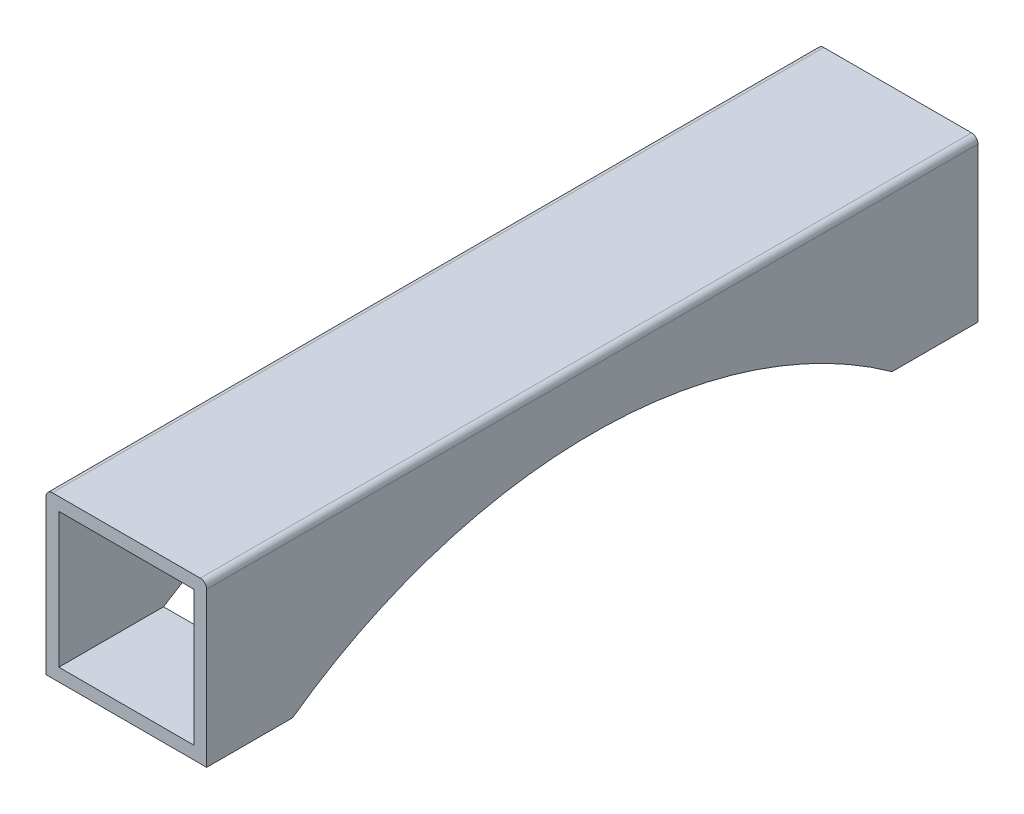
ISO-10303-21;
HEADER;
FILE_DESCRIPTION(('STEP AP214'),'2;1');
FILE_NAME('part.step','',(''),(''),'','','');
FILE_SCHEMA(('AUTOMOTIVE_DESIGN { 1 0 10303 214 1 1 1 1 }'));
ENDSEC;
DATA;
#1=APPLICATION_CONTEXT('core data for automotive mechanical design processes');
#2=APPLICATION_PROTOCOL_DEFINITION('international standard','automotive_design',2000,#1);
#3=PRODUCT_CONTEXT('',#1,'mechanical');
#4=PRODUCT('Part','Part','',(#3));
#5=PRODUCT_RELATED_PRODUCT_CATEGORY('part','',(#4));
#6=PRODUCT_DEFINITION_FORMATION('','',#4);
#7=PRODUCT_DEFINITION_CONTEXT('part definition',#1,'design');
#8=PRODUCT_DEFINITION('design','',#6,#7);
#9=PRODUCT_DEFINITION_SHAPE('','',#8);
#10=(LENGTH_UNIT() NAMED_UNIT(*) SI_UNIT(.MILLI.,.METRE.));
#11=(NAMED_UNIT(*) PLANE_ANGLE_UNIT() SI_UNIT($,.RADIAN.));
#12=(NAMED_UNIT(*) SI_UNIT($,.STERADIAN.) SOLID_ANGLE_UNIT());
#13=UNCERTAINTY_MEASURE_WITH_UNIT(LENGTH_MEASURE(1.E-05),#10,'distance_accuracy_value','');
#14=(GEOMETRIC_REPRESENTATION_CONTEXT(3) GLOBAL_UNCERTAINTY_ASSIGNED_CONTEXT((#13)) GLOBAL_UNIT_ASSIGNED_CONTEXT((#10,
#11,#12)) REPRESENTATION_CONTEXT('',''));
#15=CARTESIAN_POINT('',(0.,0.,0.));
#16=DIRECTION('',(0.,0.,1.));
#17=DIRECTION('',(1.,0.,0.));
#18=AXIS2_PLACEMENT_3D('',#15,#16,#17);
#19=CARTESIAN_POINT('',(-12.5,-12.5,-60.));
#20=DIRECTION('',(0.,-1.,0.));
#21=DIRECTION('',(0.,0.,-1.));
#22=AXIS2_PLACEMENT_3D('',#19,#20,#21);
#23=PLANE('',#22);
#24=DIRECTION('',(-1.,0.,0.));
#25=VECTOR('',#24,1.);
#26=CARTESIAN_POINT('',(12.5,-12.5,46.6368952654441));
#27=LINE('',#26,#25);
#28=CARTESIAN_POINT('',(12.5,-12.5,46.6368952654441));
#29=VERTEX_POINT('',#28);
#30=CARTESIAN_POINT('',(-12.5,-12.5,46.6368952654441));
#31=VERTEX_POINT('',#30);
#32=EDGE_CURVE('E148',#29,#31,#27,.T.);
#33=ORIENTED_EDGE('',*,*,#32,.F.);
#34=DIRECTION('',(0.,0.,1.));
#35=VECTOR('',#34,1.);
#36=CARTESIAN_POINT('',(12.5,-12.5,-60.));
#37=LINE('',#36,#35);
#38=CARTESIAN_POINT('',(12.5,-12.5,60.));
#39=VERTEX_POINT('',#38);
#40=EDGE_CURVE('E139',#29,#39,#37,.T.);
#41=ORIENTED_EDGE('',*,*,#40,.T.);
#42=DIRECTION('',(1.,0.,0.));
#43=VECTOR('',#42,1.);
#44=CARTESIAN_POINT('',(-12.5,-12.5,60.));
#45=LINE('',#44,#43);
#46=CARTESIAN_POINT('',(-12.5,-12.5,60.));
#47=VERTEX_POINT('',#46);
#48=EDGE_CURVE('E177',#47,#39,#45,.T.);
#49=ORIENTED_EDGE('',*,*,#48,.F.);
#50=DIRECTION('',(0.,0.,1.));
#51=VECTOR('',#50,1.);
#52=CARTESIAN_POINT('',(-12.5,-12.5,-60.));
#53=LINE('',#52,#51);
#54=EDGE_CURVE('E231',#31,#47,#53,.T.);
#55=ORIENTED_EDGE('',*,*,#54,.F.);
#56=EDGE_LOOP('',(#33,#41,#49,#55));
#57=FACE_BOUND('',#56,.T.);
#58=ADVANCED_FACE('F31',(#57),#23,.T.);
#59=CARTESIAN_POINT('',(-10.5,-10.5,-60.));
#60=DIRECTION('',(0.,-1.,0.));
#61=DIRECTION('',(0.,0.,-1.));
#62=AXIS2_PLACEMENT_3D('',#59,#60,#61);
#63=PLANE('',#62);
#64=DIRECTION('',(0.,0.,1.));
#65=VECTOR('',#64,1.);
#66=CARTESIAN_POINT('',(10.5,-10.5,-60.));
#67=LINE('',#66,#65);
#68=CARTESIAN_POINT('',(10.5,-10.5,43.7149859887888));
#69=VERTEX_POINT('',#68);
#70=CARTESIAN_POINT('',(10.5,-10.5,60.));
#71=VERTEX_POINT('',#70);
#72=EDGE_CURVE('E213',#69,#71,#67,.T.);
#73=ORIENTED_EDGE('',*,*,#72,.F.);
#74=DIRECTION('',(-1.,0.,0.));
#75=VECTOR('',#74,1.);
#76=CARTESIAN_POINT('',(12.5,-10.5,43.7149859887888));
#77=LINE('',#76,#75);
#78=CARTESIAN_POINT('',(-10.5,-10.5,43.7149859887888));
#79=VERTEX_POINT('',#78);
#80=EDGE_CURVE('E11',#69,#79,#77,.T.);
#81=ORIENTED_EDGE('',*,*,#80,.T.);
#82=DIRECTION('',(0.,0.,1.));
#83=VECTOR('',#82,1.);
#84=CARTESIAN_POINT('',(-10.5,-10.5,-60.));
#85=LINE('',#84,#83);
#86=CARTESIAN_POINT('',(-10.5,-10.5,60.));
#87=VERTEX_POINT('',#86);
#88=EDGE_CURVE('E204',#79,#87,#85,.T.);
#89=ORIENTED_EDGE('',*,*,#88,.T.);
#90=DIRECTION('',(1.,0.,0.));
#91=VECTOR('',#90,1.);
#92=CARTESIAN_POINT('',(-10.5,-10.5,60.));
#93=LINE('',#92,#91);
#94=EDGE_CURVE('E165',#87,#71,#93,.T.);
#95=ORIENTED_EDGE('',*,*,#94,.T.);
#96=EDGE_LOOP('',(#73,#81,#89,#95));
#97=FACE_BOUND('',#96,.T.);
#98=ADVANCED_FACE('F257',(#97),#63,.F.);
#99=CARTESIAN_POINT('',(-12.5,-12.5,-60.));
#100=DIRECTION('',(-1.,0.,0.));
#101=DIRECTION('',(0.,0.,1.));
#102=AXIS2_PLACEMENT_3D('',#99,#100,#101);
#103=PLANE('',#102);
#104=CARTESIAN_POINT('',(-12.5,-77.5,0.));
#105=DIRECTION('',(-1.,0.,0.));
#106=DIRECTION('',(0.,0.,1.));
#107=AXIS2_PLACEMENT_3D('',#104,#105,#106);
#108=CIRCLE('',#107,80.);
#109=CARTESIAN_POINT('',(-12.5,-12.5,-46.6368952654441));
#110=VERTEX_POINT('',#109);
#111=EDGE_CURVE('E46',#31,#110,#108,.T.);
#112=ORIENTED_EDGE('',*,*,#111,.F.);
#113=ORIENTED_EDGE('',*,*,#54,.T.);
#114=DIRECTION('',(0.,-1.,0.));
#115=VECTOR('',#114,1.);
#116=CARTESIAN_POINT('',(-12.5,-12.5,60.));
#117=LINE('',#116,#115);
#118=CARTESIAN_POINT('',(-12.5,11.5,60.));
#119=VERTEX_POINT('',#118);
#120=EDGE_CURVE('E174',#119,#47,#117,.T.);
#121=ORIENTED_EDGE('',*,*,#120,.F.);
#122=DIRECTION('',(0.,0.,1.));
#123=VECTOR('',#122,1.);
#124=CARTESIAN_POINT('',(-12.5,11.5,-60.));
#125=LINE('',#124,#123);
#126=CARTESIAN_POINT('',(-12.5,11.5,-60.));
#127=VERTEX_POINT('',#126);
#128=EDGE_CURVE('E232',#127,#119,#125,.T.);
#129=ORIENTED_EDGE('',*,*,#128,.F.);
#130=DIRECTION('',(0.,-1.,0.));
#131=VECTOR('',#130,1.);
#132=CARTESIAN_POINT('',(-12.5,-12.5,-60.));
#133=LINE('',#132,#131);
#134=CARTESIAN_POINT('',(-12.5,-12.5,-60.));
#135=VERTEX_POINT('',#134);
#136=EDGE_CURVE('E207',#127,#135,#133,.T.);
#137=ORIENTED_EDGE('',*,*,#136,.T.);
#138=EDGE_CURVE('E239',#135,#110,#53,.T.);
#139=ORIENTED_EDGE('',*,*,#138,.T.);
#140=EDGE_LOOP('',(#112,#113,#121,#129,#137,#139));
#141=FACE_BOUND('',#140,.T.);
#142=ADVANCED_FACE('F33',(#141),#103,.T.);
#143=CARTESIAN_POINT('',(-11.5,11.5,-60.));
#144=DIRECTION('',(0.,0.,1.));
#145=DIRECTION('',(1.,0.,0.));
#146=AXIS2_PLACEMENT_3D('',#143,#144,#145);
#147=CYLINDRICAL_SURFACE('',#146,0.999999999999999);
#148=ORIENTED_EDGE('',*,*,#128,.T.);
#149=CARTESIAN_POINT('',(-11.5,11.5,60.));
#150=DIRECTION('',(0.,0.,1.));
#151=DIRECTION('',(1.,0.,0.));
#152=AXIS2_PLACEMENT_3D('',#149,#150,#151);
#153=CIRCLE('',#152,0.999999999999999);
#154=CARTESIAN_POINT('',(-11.5,12.5,60.));
#155=VERTEX_POINT('',#154);
#156=EDGE_CURVE('E189',#155,#119,#153,.T.);
#157=ORIENTED_EDGE('',*,*,#156,.F.);
#158=DIRECTION('',(0.,0.,1.));
#159=VECTOR('',#158,1.);
#160=CARTESIAN_POINT('',(-11.5,12.5,-60.));
#161=LINE('',#160,#159);
#162=CARTESIAN_POINT('',(-11.5,12.5,-60.));
#163=VERTEX_POINT('',#162);
#164=EDGE_CURVE('E234',#163,#155,#161,.T.);
#165=ORIENTED_EDGE('',*,*,#164,.F.);
#166=CARTESIAN_POINT('',(-11.5,11.5,-60.));
#167=DIRECTION('',(0.,0.,1.));
#168=DIRECTION('',(1.,0.,0.));
#169=AXIS2_PLACEMENT_3D('',#166,#167,#168);
#170=CIRCLE('',#169,0.999999999999999);
#171=EDGE_CURVE('E228',#163,#127,#170,.T.);
#172=ORIENTED_EDGE('',*,*,#171,.T.);
#173=EDGE_LOOP('',(#148,#157,#165,#172));
#174=FACE_BOUND('',#173,.T.);
#175=ADVANCED_FACE('F298',(#174),#147,.T.);
#176=CARTESIAN_POINT('',(-11.5,12.5,-60.));
#177=DIRECTION('',(0.,1.,0.));
#178=DIRECTION('',(0.,0.,1.));
#179=AXIS2_PLACEMENT_3D('',#176,#177,#178);
#180=PLANE('',#179);
#181=ORIENTED_EDGE('',*,*,#164,.T.);
#182=DIRECTION('',(-1.,0.,0.));
#183=VECTOR('',#182,1.);
#184=CARTESIAN_POINT('',(-11.5,12.5,60.));
#185=LINE('',#184,#183);
#186=CARTESIAN_POINT('',(11.5,12.5,60.));
#187=VERTEX_POINT('',#186);
#188=EDGE_CURVE('E186',#187,#155,#185,.T.);
#189=ORIENTED_EDGE('',*,*,#188,.F.);
#190=DIRECTION('',(0.,0.,1.));
#191=VECTOR('',#190,1.);
#192=CARTESIAN_POINT('',(11.5,12.5,-60.));
#193=LINE('',#192,#191);
#194=CARTESIAN_POINT('',(11.5,12.5,-60.));
#195=VERTEX_POINT('',#194);
#196=EDGE_CURVE('E236',#195,#187,#193,.T.);
#197=ORIENTED_EDGE('',*,*,#196,.F.);
#198=DIRECTION('',(-1.,0.,0.));
#199=VECTOR('',#198,1.);
#200=CARTESIAN_POINT('',(-11.5,12.5,-60.));
#201=LINE('',#200,#199);
#202=EDGE_CURVE('E225',#195,#163,#201,.T.);
#203=ORIENTED_EDGE('',*,*,#202,.T.);
#204=EDGE_LOOP('',(#181,#189,#197,#203));
#205=FACE_BOUND('',#204,.T.);
#206=ADVANCED_FACE('F292',(#205),#180,.T.);
#207=CARTESIAN_POINT('',(11.5,11.5,-60.));
#208=DIRECTION('',(0.,0.,1.));
#209=DIRECTION('',(1.,0.,0.));
#210=AXIS2_PLACEMENT_3D('',#207,#208,#209);
#211=CYLINDRICAL_SURFACE('',#210,0.999999999999999);
#212=ORIENTED_EDGE('',*,*,#196,.T.);
#213=CARTESIAN_POINT('',(11.5,11.5,60.));
#214=DIRECTION('',(0.,0.,1.));
#215=DIRECTION('',(1.,0.,0.));
#216=AXIS2_PLACEMENT_3D('',#213,#214,#215);
#217=CIRCLE('',#216,0.999999999999999);
#218=CARTESIAN_POINT('',(12.5,11.5,60.));
#219=VERTEX_POINT('',#218);
#220=EDGE_CURVE('E183',#219,#187,#217,.T.);
#221=ORIENTED_EDGE('',*,*,#220,.F.);
#222=DIRECTION('',(0.,0.,1.));
#223=VECTOR('',#222,1.);
#224=CARTESIAN_POINT('',(12.5,11.5,-60.));
#225=LINE('',#224,#223);
#226=CARTESIAN_POINT('',(12.5,11.5,-60.));
#227=VERTEX_POINT('',#226);
#228=EDGE_CURVE('E138',#227,#219,#225,.T.);
#229=ORIENTED_EDGE('',*,*,#228,.F.);
#230=CARTESIAN_POINT('',(11.5,11.5,-60.));
#231=DIRECTION('',(0.,0.,1.));
#232=DIRECTION('',(1.,0.,0.));
#233=AXIS2_PLACEMENT_3D('',#230,#231,#232);
#234=CIRCLE('',#233,0.999999999999999);
#235=EDGE_CURVE('E222',#227,#195,#234,.T.);
#236=ORIENTED_EDGE('',*,*,#235,.T.);
#237=EDGE_LOOP('',(#212,#221,#229,#236));
#238=FACE_BOUND('',#237,.T.);
#239=ADVANCED_FACE('F288',(#238),#211,.T.);
#240=CARTESIAN_POINT('',(12.5,-12.5,-60.));
#241=DIRECTION('',(1.,0.,0.));
#242=DIRECTION('',(0.,0.,-1.));
#243=AXIS2_PLACEMENT_3D('',#240,#241,#242);
#244=PLANE('',#243);
#245=CARTESIAN_POINT('',(12.5,-77.5,0.));
#246=DIRECTION('',(-1.,0.,0.));
#247=DIRECTION('',(0.,0.,1.));
#248=AXIS2_PLACEMENT_3D('',#245,#246,#247);
#249=CIRCLE('',#248,80.);
#250=CARTESIAN_POINT('',(12.5,-12.5,-46.6368952654441));
#251=VERTEX_POINT('',#250);
#252=EDGE_CURVE('E143',#29,#251,#249,.T.);
#253=ORIENTED_EDGE('',*,*,#252,.T.);
#254=CARTESIAN_POINT('',(12.5,-12.5,-60.));
#255=VERTEX_POINT('',#254);
#256=EDGE_CURVE('E130',#255,#251,#37,.T.);
#257=ORIENTED_EDGE('',*,*,#256,.F.);
#258=DIRECTION('',(0.,1.,0.));
#259=VECTOR('',#258,1.);
#260=CARTESIAN_POINT('',(12.5,-12.5,-60.));
#261=LINE('',#260,#259);
#262=EDGE_CURVE('E220',#255,#227,#261,.T.);
#263=ORIENTED_EDGE('',*,*,#262,.T.);
#264=ORIENTED_EDGE('',*,*,#228,.T.);
#265=DIRECTION('',(0.,1.,0.));
#266=VECTOR('',#265,1.);
#267=CARTESIAN_POINT('',(12.5,-12.5,60.));
#268=LINE('',#267,#266);
#269=EDGE_CURVE('E180',#39,#219,#268,.T.);
#270=ORIENTED_EDGE('',*,*,#269,.F.);
#271=ORIENTED_EDGE('',*,*,#40,.F.);
#272=EDGE_LOOP('',(#253,#257,#263,#264,#270,#271));
#273=FACE_BOUND('',#272,.T.);
#274=ADVANCED_FACE('F144',(#273),#244,.T.);
#275=DIRECTION('',(-1.,0.,0.));
#276=VECTOR('',#275,1.);
#277=CARTESIAN_POINT('',(12.5,-12.5,-46.6368952654441));
#278=LINE('',#277,#276);
#279=EDGE_CURVE('E54',#251,#110,#278,.T.);
#280=ORIENTED_EDGE('',*,*,#279,.T.);
#281=ORIENTED_EDGE('',*,*,#138,.F.);
#282=DIRECTION('',(1.,0.,0.));
#283=VECTOR('',#282,1.);
#284=CARTESIAN_POINT('',(-12.5,-12.5,-60.));
#285=LINE('',#284,#283);
#286=EDGE_CURVE('E134',#135,#255,#285,.T.);
#287=ORIENTED_EDGE('',*,*,#286,.T.);
#288=ORIENTED_EDGE('',*,*,#256,.T.);
#289=EDGE_LOOP('',(#280,#281,#287,#288));
#290=FACE_BOUND('',#289,.T.);
#291=ADVANCED_FACE('F132',(#290),#23,.T.);
#292=CARTESIAN_POINT('',(-11.5,11.5,-60.));
#293=DIRECTION('',(0.,0.,1.));
#294=DIRECTION('',(1.,0.,0.));
#295=AXIS2_PLACEMENT_3D('',#292,#293,#294);
#296=PLANE('',#295);
#297=DIRECTION('',(-1.,0.,0.));
#298=VECTOR('',#297,1.);
#299=CARTESIAN_POINT('',(-10.5,10.5,-60.));
#300=LINE('',#299,#298);
#301=CARTESIAN_POINT('',(10.5,10.5,-60.));
#302=VERTEX_POINT('',#301);
#303=CARTESIAN_POINT('',(-10.5,10.5,-60.));
#304=VERTEX_POINT('',#303);
#305=EDGE_CURVE('E201',#302,#304,#300,.T.);
#306=ORIENTED_EDGE('',*,*,#305,.T.);
#307=DIRECTION('',(0.,-1.,0.));
#308=VECTOR('',#307,1.);
#309=CARTESIAN_POINT('',(-10.5,-10.5,-60.));
#310=LINE('',#309,#308);
#311=CARTESIAN_POINT('',(-10.5,-10.5,-60.));
#312=VERTEX_POINT('',#311);
#313=EDGE_CURVE('E192',#304,#312,#310,.T.);
#314=ORIENTED_EDGE('',*,*,#313,.T.);
#315=DIRECTION('',(1.,0.,0.));
#316=VECTOR('',#315,1.);
#317=CARTESIAN_POINT('',(-10.5,-10.5,-60.));
#318=LINE('',#317,#316);
#319=CARTESIAN_POINT('',(10.5,-10.5,-60.));
#320=VERTEX_POINT('',#319);
#321=EDGE_CURVE('E195',#312,#320,#318,.T.);
#322=ORIENTED_EDGE('',*,*,#321,.T.);
#323=DIRECTION('',(0.,1.,0.));
#324=VECTOR('',#323,1.);
#325=CARTESIAN_POINT('',(10.5,-10.5,-60.));
#326=LINE('',#325,#324);
#327=EDGE_CURVE('E198',#320,#302,#326,.T.);
#328=ORIENTED_EDGE('',*,*,#327,.T.);
#329=EDGE_LOOP('',(#306,#314,#322,#328));
#330=FACE_BOUND('',#329,.T.);
#331=ORIENTED_EDGE('',*,*,#136,.F.);
#332=ORIENTED_EDGE('',*,*,#171,.F.);
#333=ORIENTED_EDGE('',*,*,#202,.F.);
#334=ORIENTED_EDGE('',*,*,#235,.F.);
#335=ORIENTED_EDGE('',*,*,#262,.F.);
#336=ORIENTED_EDGE('',*,*,#286,.F.);
#337=EDGE_LOOP('',(#331,#332,#333,#334,#335,#336));
#338=FACE_BOUND('',#337,.T.);
#339=ADVANCED_FACE('F250',(#330,#338),#296,.F.);
#340=CARTESIAN_POINT('',(-10.5,-10.5,-60.));
#341=DIRECTION('',(-1.,0.,0.));
#342=DIRECTION('',(0.,0.,1.));
#343=AXIS2_PLACEMENT_3D('',#340,#341,#342);
#344=PLANE('',#343);
#345=ORIENTED_EDGE('',*,*,#88,.F.);
#346=CARTESIAN_POINT('',(-10.5,-77.5,0.));
#347=DIRECTION('',(-1.,0.,0.));
#348=DIRECTION('',(0.,0.,1.));
#349=AXIS2_PLACEMENT_3D('',#346,#347,#348);
#350=CIRCLE('',#349,80.);
#351=CARTESIAN_POINT('',(-10.5,-10.5,-43.7149859887888));
#352=VERTEX_POINT('',#351);
#353=EDGE_CURVE('E155',#79,#352,#350,.T.);
#354=ORIENTED_EDGE('',*,*,#353,.T.);
#355=EDGE_CURVE('E214',#312,#352,#85,.T.);
#356=ORIENTED_EDGE('',*,*,#355,.F.);
#357=ORIENTED_EDGE('',*,*,#313,.F.);
#358=DIRECTION('',(0.,0.,1.));
#359=VECTOR('',#358,1.);
#360=CARTESIAN_POINT('',(-10.5,10.5,-60.));
#361=LINE('',#360,#359);
#362=CARTESIAN_POINT('',(-10.5,10.5,60.));
#363=VERTEX_POINT('',#362);
#364=EDGE_CURVE('E205',#304,#363,#361,.T.);
#365=ORIENTED_EDGE('',*,*,#364,.T.);
#366=DIRECTION('',(0.,-1.,0.));
#367=VECTOR('',#366,1.);
#368=CARTESIAN_POINT('',(-10.5,-10.5,60.));
#369=LINE('',#368,#367);
#370=EDGE_CURVE('E162',#363,#87,#369,.T.);
#371=ORIENTED_EDGE('',*,*,#370,.T.);
#372=EDGE_LOOP('',(#345,#354,#356,#357,#365,#371));
#373=FACE_BOUND('',#372,.T.);
#374=ADVANCED_FACE('F255',(#373),#344,.F.);
#375=CARTESIAN_POINT('',(-10.5,10.5,-60.));
#376=DIRECTION('',(0.,1.,0.));
#377=DIRECTION('',(-1.,0.,0.));
#378=AXIS2_PLACEMENT_3D('',#375,#376,#377);
#379=PLANE('',#378);
#380=DIRECTION('',(0.,0.,1.));
#381=VECTOR('',#380,1.);
#382=CARTESIAN_POINT('',(10.5,10.5,-60.));
#383=LINE('',#382,#381);
#384=CARTESIAN_POINT('',(10.5,10.5,60.));
#385=VERTEX_POINT('',#384);
#386=EDGE_CURVE('E208',#302,#385,#383,.T.);
#387=ORIENTED_EDGE('',*,*,#386,.T.);
#388=DIRECTION('',(-1.,0.,0.));
#389=VECTOR('',#388,1.);
#390=CARTESIAN_POINT('',(-10.5,10.5,60.));
#391=LINE('',#390,#389);
#392=EDGE_CURVE('E171',#385,#363,#391,.T.);
#393=ORIENTED_EDGE('',*,*,#392,.T.);
#394=ORIENTED_EDGE('',*,*,#364,.F.);
#395=ORIENTED_EDGE('',*,*,#305,.F.);
#396=EDGE_LOOP('',(#387,#393,#394,#395));
#397=FACE_BOUND('',#396,.T.);
#398=ADVANCED_FACE('F265',(#397),#379,.F.);
#399=CARTESIAN_POINT('',(10.5,-10.5,-60.));
#400=DIRECTION('',(1.,0.,0.));
#401=DIRECTION('',(0.,1.,0.));
#402=AXIS2_PLACEMENT_3D('',#399,#400,#401);
#403=PLANE('',#402);
#404=CARTESIAN_POINT('',(10.5,-10.5,-43.7149859887888));
#405=VERTEX_POINT('',#404);
#406=EDGE_CURVE('E210',#320,#405,#67,.T.);
#407=ORIENTED_EDGE('',*,*,#406,.T.);
#408=CARTESIAN_POINT('',(10.5,-77.5,0.));
#409=DIRECTION('',(1.,0.,0.));
#410=DIRECTION('',(0.,1.,0.));
#411=AXIS2_PLACEMENT_3D('',#408,#409,#410);
#412=CIRCLE('',#411,80.);
#413=EDGE_CURVE('E152',#405,#69,#412,.T.);
#414=ORIENTED_EDGE('',*,*,#413,.T.);
#415=ORIENTED_EDGE('',*,*,#72,.T.);
#416=DIRECTION('',(0.,1.,0.));
#417=VECTOR('',#416,1.);
#418=CARTESIAN_POINT('',(10.5,-10.5,60.));
#419=LINE('',#418,#417);
#420=EDGE_CURVE('E168',#71,#385,#419,.T.);
#421=ORIENTED_EDGE('',*,*,#420,.T.);
#422=ORIENTED_EDGE('',*,*,#386,.F.);
#423=ORIENTED_EDGE('',*,*,#327,.F.);
#424=EDGE_LOOP('',(#407,#414,#415,#421,#422,#423));
#425=FACE_BOUND('',#424,.T.);
#426=ADVANCED_FACE('F246',(#425),#403,.F.);
#427=ORIENTED_EDGE('',*,*,#355,.T.);
#428=DIRECTION('',(-1.,0.,0.));
#429=VECTOR('',#428,1.);
#430=CARTESIAN_POINT('',(12.5,-10.5,-43.7149859887888));
#431=LINE('',#430,#429);
#432=EDGE_CURVE('E39',#352,#405,#431,.F.);
#433=ORIENTED_EDGE('',*,*,#432,.T.);
#434=ORIENTED_EDGE('',*,*,#406,.F.);
#435=ORIENTED_EDGE('',*,*,#321,.F.);
#436=EDGE_LOOP('',(#427,#433,#434,#435));
#437=FACE_BOUND('',#436,.T.);
#438=ADVANCED_FACE('F243',(#437),#63,.F.);
#439=CARTESIAN_POINT('',(-11.5,11.5,60.));
#440=DIRECTION('',(0.,0.,1.));
#441=DIRECTION('',(1.,0.,0.));
#442=AXIS2_PLACEMENT_3D('',#439,#440,#441);
#443=PLANE('',#442);
#444=ORIENTED_EDGE('',*,*,#120,.T.);
#445=ORIENTED_EDGE('',*,*,#48,.T.);
#446=ORIENTED_EDGE('',*,*,#269,.T.);
#447=ORIENTED_EDGE('',*,*,#220,.T.);
#448=ORIENTED_EDGE('',*,*,#188,.T.);
#449=ORIENTED_EDGE('',*,*,#156,.T.);
#450=EDGE_LOOP('',(#444,#445,#446,#447,#448,#449));
#451=FACE_BOUND('',#450,.T.);
#452=ORIENTED_EDGE('',*,*,#94,.F.);
#453=ORIENTED_EDGE('',*,*,#370,.F.);
#454=ORIENTED_EDGE('',*,*,#392,.F.);
#455=ORIENTED_EDGE('',*,*,#420,.F.);
#456=EDGE_LOOP('',(#452,#453,#454,#455));
#457=FACE_BOUND('',#456,.T.);
#458=ADVANCED_FACE('F263',(#451,#457),#443,.T.);
#459=CARTESIAN_POINT('',(12.5,-77.5,0.));
#460=DIRECTION('',(-1.,0.,0.));
#461=DIRECTION('',(0.,0.,1.));
#462=AXIS2_PLACEMENT_3D('',#459,#460,#461);
#463=CYLINDRICAL_SURFACE('',#462,80.);
#464=ORIENTED_EDGE('',*,*,#32,.T.);
#465=ORIENTED_EDGE('',*,*,#111,.T.);
#466=ORIENTED_EDGE('',*,*,#279,.F.);
#467=ORIENTED_EDGE('',*,*,#252,.F.);
#468=EDGE_LOOP('',(#464,#465,#466,#467));
#469=FACE_BOUND('',#468,.T.);
#470=ORIENTED_EDGE('',*,*,#80,.F.);
#471=ORIENTED_EDGE('',*,*,#413,.F.);
#472=ORIENTED_EDGE('',*,*,#432,.F.);
#473=ORIENTED_EDGE('',*,*,#353,.F.);
#474=EDGE_LOOP('',(#470,#471,#472,#473));
#475=FACE_BOUND('',#474,.T.);
#476=ADVANCED_FACE('F150',(#469,#475),#463,.F.);
#477=CLOSED_SHELL('',(#58,#98,#142,#175,#206,#239,#274,#291,#339,#374,#398,#426,#438,#458,#476));
#478=MANIFOLD_SOLID_BREP('B2',#477);
#479=ADVANCED_BREP_SHAPE_REPRESENTATION('',(#18,#478),#14);
#480=SHAPE_DEFINITION_REPRESENTATION(#9,#479);
ENDSEC;
END-ISO-10303-21;
